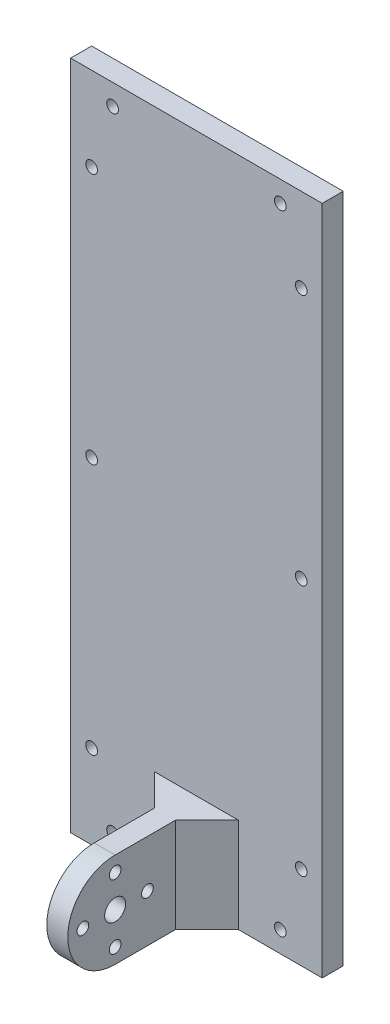
ISO-10303-21;
HEADER;
FILE_DESCRIPTION(('STEP AP214'),'2;1');
FILE_NAME('part.step','',(''),(''),'','','');
FILE_SCHEMA(('AUTOMOTIVE_DESIGN { 1 0 10303 214 1 1 1 1 }'));
ENDSEC;
DATA;
#1=APPLICATION_CONTEXT('core data for automotive mechanical design processes');
#2=APPLICATION_PROTOCOL_DEFINITION('international standard','automotive_design',2000,#1);
#3=PRODUCT_CONTEXT('',#1,'mechanical');
#4=PRODUCT('Part','Part','',(#3));
#5=PRODUCT_RELATED_PRODUCT_CATEGORY('part','',(#4));
#6=PRODUCT_DEFINITION_FORMATION('','',#4);
#7=PRODUCT_DEFINITION_CONTEXT('part definition',#1,'design');
#8=PRODUCT_DEFINITION('design','',#6,#7);
#9=PRODUCT_DEFINITION_SHAPE('','',#8);
#10=(LENGTH_UNIT() NAMED_UNIT(*) SI_UNIT(.MILLI.,.METRE.));
#11=(NAMED_UNIT(*) PLANE_ANGLE_UNIT() SI_UNIT($,.RADIAN.));
#12=(NAMED_UNIT(*) SI_UNIT($,.STERADIAN.) SOLID_ANGLE_UNIT());
#13=UNCERTAINTY_MEASURE_WITH_UNIT(LENGTH_MEASURE(1.E-05),#10,'distance_accuracy_value','');
#14=(GEOMETRIC_REPRESENTATION_CONTEXT(3) GLOBAL_UNCERTAINTY_ASSIGNED_CONTEXT((#13)) GLOBAL_UNIT_ASSIGNED_CONTEXT((#10,
#11,#12)) REPRESENTATION_CONTEXT('',''));
#15=CARTESIAN_POINT('',(0.,0.,0.));
#16=DIRECTION('',(0.,0.,1.));
#17=DIRECTION('',(1.,0.,0.));
#18=AXIS2_PLACEMENT_3D('',#15,#16,#17);
#19=CARTESIAN_POINT('',(0.,0.,6.35));
#20=DIRECTION('',(0.,1.,0.));
#21=DIRECTION('',(0.,0.,1.));
#22=AXIS2_PLACEMENT_3D('',#19,#20,#21);
#23=PLANE('',#22);
#24=DIRECTION('',(0.,0.,-1.));
#25=VECTOR('',#24,1.);
#26=CARTESIAN_POINT('',(34.925,0.,50.8));
#27=LINE('',#26,#25);
#28=CARTESIAN_POINT('',(34.925,0.,34.154615714));
#29=VERTEX_POINT('',#28);
#30=CARTESIAN_POINT('',(34.925,0.,15.875));
#31=VERTEX_POINT('',#30);
#32=EDGE_CURVE('E148',#29,#31,#27,.T.);
#33=ORIENTED_EDGE('',*,*,#32,.T.);
#34=DIRECTION('',(-0.707106781186548,0.,-0.707106781186547));
#35=VECTOR('',#34,1.);
#36=CARTESIAN_POINT('',(34.925,0.,15.875));
#37=LINE('',#36,#35);
#38=CARTESIAN_POINT('',(25.4,0.,6.35));
#39=VERTEX_POINT('',#38);
#40=EDGE_CURVE('E179',#31,#39,#37,.T.);
#41=ORIENTED_EDGE('',*,*,#40,.T.);
#42=DIRECTION('',(1.,0.,0.));
#43=VECTOR('',#42,1.);
#44=CARTESIAN_POINT('',(0.,0.,6.35));
#45=LINE('',#44,#43);
#46=CARTESIAN_POINT('',(0.,0.,6.35));
#47=VERTEX_POINT('',#46);
#48=EDGE_CURVE('E131',#47,#39,#45,.T.);
#49=ORIENTED_EDGE('',*,*,#48,.F.);
#50=DIRECTION('',(0.,0.,-1.));
#51=VECTOR('',#50,1.);
#52=CARTESIAN_POINT('',(0.,0.,6.35));
#53=LINE('',#52,#51);
#54=CARTESIAN_POINT('',(0.,0.,0.));
#55=VERTEX_POINT('',#54);
#56=EDGE_CURVE('E11',#47,#55,#53,.T.);
#57=ORIENTED_EDGE('',*,*,#56,.T.);
#58=DIRECTION('',(1.,0.,0.));
#59=VECTOR('',#58,1.);
#60=CARTESIAN_POINT('',(0.,0.,0.));
#61=LINE('',#60,#59);
#62=CARTESIAN_POINT('',(76.2,0.,0.));
#63=VERTEX_POINT('',#62);
#64=EDGE_CURVE('E147',#55,#63,#61,.T.);
#65=ORIENTED_EDGE('',*,*,#64,.T.);
#66=DIRECTION('',(0.,0.,-1.));
#67=VECTOR('',#66,1.);
#68=CARTESIAN_POINT('',(76.2,0.,6.35));
#69=LINE('',#68,#67);
#70=CARTESIAN_POINT('',(76.2,0.,6.35));
#71=VERTEX_POINT('',#70);
#72=EDGE_CURVE('E41',#71,#63,#69,.T.);
#73=ORIENTED_EDGE('',*,*,#72,.F.);
#74=CARTESIAN_POINT('',(50.8,0.,6.35));
#75=VERTEX_POINT('',#74);
#76=EDGE_CURVE('E126',#75,#71,#45,.T.);
#77=ORIENTED_EDGE('',*,*,#76,.F.);
#78=DIRECTION('',(-0.707106781186547,0.,0.707106781186548));
#79=VECTOR('',#78,1.);
#80=CARTESIAN_POINT('',(41.275,0.,15.875));
#81=LINE('',#80,#79);
#82=CARTESIAN_POINT('',(41.275,0.,15.875));
#83=VERTEX_POINT('',#82);
#84=EDGE_CURVE('E112',#75,#83,#81,.T.);
#85=ORIENTED_EDGE('',*,*,#84,.T.);
#86=DIRECTION('',(0.,0.,-1.));
#87=VECTOR('',#86,1.);
#88=CARTESIAN_POINT('',(41.275,0.,50.8));
#89=LINE('',#88,#87);
#90=CARTESIAN_POINT('',(41.275,0.,34.154615714));
#91=VERTEX_POINT('',#90);
#92=EDGE_CURVE('E295',#91,#83,#89,.T.);
#93=ORIENTED_EDGE('',*,*,#92,.F.);
#94=DIRECTION('',(1.,0.,0.));
#95=VECTOR('',#94,1.);
#96=CARTESIAN_POINT('',(34.925,0.,34.154615714));
#97=LINE('',#96,#95);
#98=EDGE_CURVE('E255',#29,#91,#97,.T.);
#99=ORIENTED_EDGE('',*,*,#98,.F.);
#100=EDGE_LOOP('',(#33,#41,#49,#57,#65,#73,#77,#85,#93,#99));
#101=FACE_BOUND('',#100,.T.);
#102=ADVANCED_FACE('F33',(#101),#23,.F.);
#103=CARTESIAN_POINT('',(34.925,28.702,50.8));
#104=DIRECTION('',(1.,0.,0.));
#105=DIRECTION('',(0.,1.,0.));
#106=AXIS2_PLACEMENT_3D('',#103,#104,#105);
#107=PLANE('',#106);
#108=CARTESIAN_POINT('',(34.925,14.351,34.154615714));
#109=DIRECTION('',(1.,0.,0.));
#110=DIRECTION('',(0.,0.,-1.));
#111=AXIS2_PLACEMENT_3D('',#108,#109,#110);
#112=CIRCLE('',#111,3.175);
#113=CARTESIAN_POINT('',(34.925,14.351,30.979615714));
#114=VERTEX_POINT('',#113);
#115=EDGE_CURVE('E284',#114,#114,#112,.T.);
#116=ORIENTED_EDGE('',*,*,#115,.T.);
#117=EDGE_LOOP('',(#116));
#118=FACE_BOUND('',#117,.T.);
#119=CARTESIAN_POINT('',(34.925,14.351,43.933615714));
#120=DIRECTION('',(1.,0.,0.));
#121=DIRECTION('',(0.,0.,-1.));
#122=AXIS2_PLACEMENT_3D('',#119,#120,#121);
#123=CIRCLE('',#122,1.778);
#124=CARTESIAN_POINT('',(34.925,14.351,42.155615714));
#125=VERTEX_POINT('',#124);
#126=EDGE_CURVE('E278',#125,#125,#123,.T.);
#127=ORIENTED_EDGE('',*,*,#126,.T.);
#128=EDGE_LOOP('',(#127));
#129=FACE_BOUND('',#128,.T.);
#130=CARTESIAN_POINT('',(34.925,24.13,34.1546157140001));
#131=DIRECTION('',(1.,0.,0.));
#132=DIRECTION('',(0.,-1.,0.));
#133=AXIS2_PLACEMENT_3D('',#130,#131,#132);
#134=CIRCLE('',#133,1.778);
#135=CARTESIAN_POINT('',(34.925,22.352,34.1546157140001));
#136=VERTEX_POINT('',#135);
#137=EDGE_CURVE('E273',#136,#136,#134,.T.);
#138=ORIENTED_EDGE('',*,*,#137,.T.);
#139=EDGE_LOOP('',(#138));
#140=FACE_BOUND('',#139,.T.);
#141=CARTESIAN_POINT('',(34.925,14.351,24.375615714));
#142=DIRECTION('',(1.,0.,0.));
#143=DIRECTION('',(0.,0.,1.));
#144=AXIS2_PLACEMENT_3D('',#141,#142,#143);
#145=CIRCLE('',#144,1.778);
#146=CARTESIAN_POINT('',(34.925,14.351,26.153615714));
#147=VERTEX_POINT('',#146);
#148=EDGE_CURVE('E267',#147,#147,#145,.T.);
#149=ORIENTED_EDGE('',*,*,#148,.T.);
#150=EDGE_LOOP('',(#149));
#151=FACE_BOUND('',#150,.T.);
#152=CARTESIAN_POINT('',(34.925,4.572,34.154615714));
#153=DIRECTION('',(1.,0.,0.));
#154=DIRECTION('',(0.,1.,0.));
#155=AXIS2_PLACEMENT_3D('',#152,#153,#154);
#156=CIRCLE('',#155,1.778);
#157=CARTESIAN_POINT('',(34.925,6.35,34.154615714));
#158=VERTEX_POINT('',#157);
#159=EDGE_CURVE('E260',#158,#158,#156,.T.);
#160=ORIENTED_EDGE('',*,*,#159,.T.);
#161=EDGE_LOOP('',(#160));
#162=FACE_BOUND('',#161,.T.);
#163=DIRECTION('',(0.,0.,-1.));
#164=VECTOR('',#163,1.);
#165=CARTESIAN_POINT('',(34.925,28.702,50.8));
#166=LINE('',#165,#164);
#167=CARTESIAN_POINT('',(34.925,28.702,34.154615714));
#168=VERTEX_POINT('',#167);
#169=CARTESIAN_POINT('',(34.925,28.702,15.875));
#170=VERTEX_POINT('',#169);
#171=EDGE_CURVE('E290',#168,#170,#166,.T.);
#172=ORIENTED_EDGE('',*,*,#171,.T.);
#173=DIRECTION('',(0.,-1.,0.));
#174=VECTOR('',#173,1.);
#175=CARTESIAN_POINT('',(34.925,42.1723841816037,15.875));
#176=LINE('',#175,#174);
#177=EDGE_CURVE('E48',#170,#31,#176,.T.);
#178=ORIENTED_EDGE('',*,*,#177,.T.);
#179=ORIENTED_EDGE('',*,*,#32,.F.);
#180=CARTESIAN_POINT('',(34.925,14.351,34.154615714));
#181=DIRECTION('',(1.,0.,0.));
#182=DIRECTION('',(0.,0.,-1.));
#183=AXIS2_PLACEMENT_3D('',#180,#181,#182);
#184=CIRCLE('',#183,14.351);
#185=EDGE_CURVE('E250',#168,#29,#184,.T.);
#186=ORIENTED_EDGE('',*,*,#185,.F.);
#187=EDGE_LOOP('',(#172,#178,#179,#186));
#188=FACE_BOUND('',#187,.T.);
#189=ADVANCED_FACE('F301',(#118,#129,#140,#151,#162,#188),#107,.F.);
#190=CARTESIAN_POINT('',(41.275,28.702,50.8));
#191=DIRECTION('',(-1.,0.,0.));
#192=DIRECTION('',(0.,0.,1.));
#193=AXIS2_PLACEMENT_3D('',#190,#191,#192);
#194=PLANE('',#193);
#195=CARTESIAN_POINT('',(41.275,14.351,34.154615714));
#196=DIRECTION('',(1.,0.,0.));
#197=DIRECTION('',(0.,0.,-1.));
#198=AXIS2_PLACEMENT_3D('',#195,#196,#197);
#199=CIRCLE('',#198,3.175);
#200=CARTESIAN_POINT('',(41.275,14.351,30.979615714));
#201=VERTEX_POINT('',#200);
#202=EDGE_CURVE('E281',#201,#201,#199,.T.);
#203=ORIENTED_EDGE('',*,*,#202,.F.);
#204=EDGE_LOOP('',(#203));
#205=FACE_BOUND('',#204,.T.);
#206=CARTESIAN_POINT('',(41.275,14.351,43.933615714));
#207=DIRECTION('',(1.,0.,0.));
#208=DIRECTION('',(0.,0.,-1.));
#209=AXIS2_PLACEMENT_3D('',#206,#207,#208);
#210=CIRCLE('',#209,1.778);
#211=CARTESIAN_POINT('',(41.275,14.351,42.155615714));
#212=VERTEX_POINT('',#211);
#213=EDGE_CURVE('E263',#212,#212,#210,.T.);
#214=ORIENTED_EDGE('',*,*,#213,.F.);
#215=EDGE_LOOP('',(#214));
#216=FACE_BOUND('',#215,.T.);
#217=CARTESIAN_POINT('',(41.275,24.13,34.1546157140001));
#218=DIRECTION('',(1.,0.,0.));
#219=DIRECTION('',(0.,-1.,0.));
#220=AXIS2_PLACEMENT_3D('',#217,#218,#219);
#221=CIRCLE('',#220,1.778);
#222=CARTESIAN_POINT('',(41.275,22.352,34.1546157140001));
#223=VERTEX_POINT('',#222);
#224=EDGE_CURVE('E257',#223,#223,#221,.T.);
#225=ORIENTED_EDGE('',*,*,#224,.F.);
#226=EDGE_LOOP('',(#225));
#227=FACE_BOUND('',#226,.T.);
#228=CARTESIAN_POINT('',(41.275,14.351,24.375615714));
#229=DIRECTION('',(1.,0.,0.));
#230=DIRECTION('',(0.,0.,1.));
#231=AXIS2_PLACEMENT_3D('',#228,#229,#230);
#232=CIRCLE('',#231,1.778);
#233=CARTESIAN_POINT('',(41.275,14.351,26.153615714));
#234=VERTEX_POINT('',#233);
#235=EDGE_CURVE('E270',#234,#234,#232,.T.);
#236=ORIENTED_EDGE('',*,*,#235,.F.);
#237=EDGE_LOOP('',(#236));
#238=FACE_BOUND('',#237,.T.);
#239=CARTESIAN_POINT('',(41.275,4.572,34.154615714));
#240=DIRECTION('',(1.,0.,0.));
#241=DIRECTION('',(0.,1.,0.));
#242=AXIS2_PLACEMENT_3D('',#239,#240,#241);
#243=CIRCLE('',#242,1.778);
#244=CARTESIAN_POINT('',(41.275,6.35,34.154615714));
#245=VERTEX_POINT('',#244);
#246=EDGE_CURVE('E264',#245,#245,#243,.T.);
#247=ORIENTED_EDGE('',*,*,#246,.F.);
#248=EDGE_LOOP('',(#247));
#249=FACE_BOUND('',#248,.T.);
#250=ORIENTED_EDGE('',*,*,#92,.T.);
#251=DIRECTION('',(0.,-1.,0.));
#252=VECTOR('',#251,1.);
#253=CARTESIAN_POINT('',(41.275,42.1723841816037,15.875));
#254=LINE('',#253,#252);
#255=CARTESIAN_POINT('',(41.275,28.702,15.875));
#256=VERTEX_POINT('',#255);
#257=EDGE_CURVE('E117',#256,#83,#254,.T.);
#258=ORIENTED_EDGE('',*,*,#257,.F.);
#259=DIRECTION('',(0.,0.,-1.));
#260=VECTOR('',#259,1.);
#261=CARTESIAN_POINT('',(41.275,28.702,50.8));
#262=LINE('',#261,#260);
#263=CARTESIAN_POINT('',(41.275,28.702,34.154615714));
#264=VERTEX_POINT('',#263);
#265=EDGE_CURVE('E292',#264,#256,#262,.T.);
#266=ORIENTED_EDGE('',*,*,#265,.F.);
#267=CARTESIAN_POINT('',(41.275,14.351,34.154615714));
#268=DIRECTION('',(1.,0.,0.));
#269=DIRECTION('',(0.,0.,-1.));
#270=AXIS2_PLACEMENT_3D('',#267,#268,#269);
#271=CIRCLE('',#270,14.351);
#272=EDGE_CURVE('E247',#264,#91,#271,.T.);
#273=ORIENTED_EDGE('',*,*,#272,.T.);
#274=EDGE_LOOP('',(#250,#258,#266,#273));
#275=FACE_BOUND('',#274,.T.);
#276=ADVANCED_FACE('F297',(#205,#216,#227,#238,#249,#275),#194,.F.);
#277=CARTESIAN_POINT('',(0.,0.,6.35));
#278=DIRECTION('',(0.,0.,-1.));
#279=DIRECTION('',(-1.,0.,0.));
#280=AXIS2_PLACEMENT_3D('',#277,#278,#279);
#281=PLANE('',#280);
#282=CARTESIAN_POINT('',(69.85,177.8,6.35));
#283=DIRECTION('',(0.,0.,-1.));
#284=DIRECTION('',(-1.,0.,0.));
#285=AXIS2_PLACEMENT_3D('',#282,#283,#284);
#286=CIRCLE('',#285,1.778);
#287=CARTESIAN_POINT('',(68.072,177.8,6.35));
#288=VERTEX_POINT('',#287);
#289=EDGE_CURVE('E208',#288,#288,#286,.T.);
#290=ORIENTED_EDGE('',*,*,#289,.T.);
#291=EDGE_LOOP('',(#290));
#292=FACE_BOUND('',#291,.T.);
#293=CARTESIAN_POINT('',(63.5,196.85,6.35));
#294=DIRECTION('',(0.,0.,-1.));
#295=DIRECTION('',(-1.,0.,0.));
#296=AXIS2_PLACEMENT_3D('',#293,#294,#295);
#297=CIRCLE('',#296,1.77799999999999);
#298=CARTESIAN_POINT('',(61.722,196.85,6.35));
#299=VERTEX_POINT('',#298);
#300=EDGE_CURVE('E215',#299,#299,#297,.T.);
#301=ORIENTED_EDGE('',*,*,#300,.T.);
#302=EDGE_LOOP('',(#301));
#303=FACE_BOUND('',#302,.T.);
#304=CARTESIAN_POINT('',(12.7,196.85,6.35));
#305=DIRECTION('',(0.,0.,-1.));
#306=DIRECTION('',(-1.,0.,0.));
#307=AXIS2_PLACEMENT_3D('',#304,#305,#306);
#308=CIRCLE('',#307,1.778);
#309=CARTESIAN_POINT('',(10.922,196.85,6.35));
#310=VERTEX_POINT('',#309);
#311=EDGE_CURVE('E196',#310,#310,#308,.T.);
#312=ORIENTED_EDGE('',*,*,#311,.T.);
#313=EDGE_LOOP('',(#312));
#314=FACE_BOUND('',#313,.T.);
#315=CARTESIAN_POINT('',(69.85,101.6,6.35));
#316=DIRECTION('',(0.,0.,-1.));
#317=DIRECTION('',(-1.,0.,0.));
#318=AXIS2_PLACEMENT_3D('',#315,#316,#317);
#319=CIRCLE('',#318,1.778);
#320=CARTESIAN_POINT('',(68.072,101.6,6.35));
#321=VERTEX_POINT('',#320);
#322=EDGE_CURVE('E203',#321,#321,#319,.T.);
#323=ORIENTED_EDGE('',*,*,#322,.T.);
#324=EDGE_LOOP('',(#323));
#325=FACE_BOUND('',#324,.T.);
#326=CARTESIAN_POINT('',(12.7,6.35,6.35));
#327=DIRECTION('',(0.,0.,-1.));
#328=DIRECTION('',(-1.,0.,0.));
#329=AXIS2_PLACEMENT_3D('',#326,#327,#328);
#330=CIRCLE('',#329,1.778);
#331=CARTESIAN_POINT('',(10.922,6.35,6.35));
#332=VERTEX_POINT('',#331);
#333=EDGE_CURVE('E232',#332,#332,#330,.T.);
#334=ORIENTED_EDGE('',*,*,#333,.T.);
#335=EDGE_LOOP('',(#334));
#336=FACE_BOUND('',#335,.T.);
#337=CARTESIAN_POINT('',(6.35,177.8,6.35));
#338=DIRECTION('',(0.,0.,-1.));
#339=DIRECTION('',(-1.,0.,0.));
#340=AXIS2_PLACEMENT_3D('',#337,#338,#339);
#341=CIRCLE('',#340,1.77799999999999);
#342=CARTESIAN_POINT('',(4.57200000000001,177.8,6.35));
#343=VERTEX_POINT('',#342);
#344=EDGE_CURVE('E239',#343,#343,#341,.T.);
#345=ORIENTED_EDGE('',*,*,#344,.T.);
#346=EDGE_LOOP('',(#345));
#347=FACE_BOUND('',#346,.T.);
#348=CARTESIAN_POINT('',(6.35,25.4,6.35));
#349=DIRECTION('',(0.,0.,-1.));
#350=DIRECTION('',(-1.,0.,0.));
#351=AXIS2_PLACEMENT_3D('',#348,#349,#350);
#352=CIRCLE('',#351,1.778);
#353=CARTESIAN_POINT('',(4.572,25.4,6.35));
#354=VERTEX_POINT('',#353);
#355=EDGE_CURVE('E220',#354,#354,#352,.T.);
#356=ORIENTED_EDGE('',*,*,#355,.T.);
#357=EDGE_LOOP('',(#356));
#358=FACE_BOUND('',#357,.T.);
#359=CARTESIAN_POINT('',(69.85,25.4,6.35));
#360=DIRECTION('',(0.,0.,-1.));
#361=DIRECTION('',(-1.,0.,0.));
#362=AXIS2_PLACEMENT_3D('',#359,#360,#361);
#363=CIRCLE('',#362,1.77800000000001);
#364=CARTESIAN_POINT('',(68.072,25.4,6.35));
#365=VERTEX_POINT('',#364);
#366=EDGE_CURVE('E227',#365,#365,#363,.T.);
#367=ORIENTED_EDGE('',*,*,#366,.T.);
#368=EDGE_LOOP('',(#367));
#369=FACE_BOUND('',#368,.T.);
#370=CARTESIAN_POINT('',(6.35,101.6,6.35));
#371=DIRECTION('',(0.,0.,-1.));
#372=DIRECTION('',(-1.,0.,0.));
#373=AXIS2_PLACEMENT_3D('',#370,#371,#372);
#374=CIRCLE('',#373,1.778);
#375=CARTESIAN_POINT('',(4.572,101.6,6.35));
#376=VERTEX_POINT('',#375);
#377=EDGE_CURVE('E190',#376,#376,#374,.T.);
#378=ORIENTED_EDGE('',*,*,#377,.T.);
#379=EDGE_LOOP('',(#378));
#380=FACE_BOUND('',#379,.T.);
#381=CARTESIAN_POINT('',(63.5,6.35,6.35));
#382=DIRECTION('',(0.,0.,-1.));
#383=DIRECTION('',(-1.,0.,0.));
#384=AXIS2_PLACEMENT_3D('',#381,#382,#383);
#385=CIRCLE('',#384,1.778);
#386=CARTESIAN_POINT('',(61.722,6.35,6.35));
#387=VERTEX_POINT('',#386);
#388=EDGE_CURVE('E244',#387,#387,#385,.T.);
#389=ORIENTED_EDGE('',*,*,#388,.T.);
#390=EDGE_LOOP('',(#389));
#391=FACE_BOUND('',#390,.T.);
#392=ORIENTED_EDGE('',*,*,#48,.T.);
#393=DIRECTION('',(0.,-1.,0.));
#394=VECTOR('',#393,1.);
#395=CARTESIAN_POINT('',(25.4,42.1723841816037,6.35));
#396=LINE('',#395,#394);
#397=CARTESIAN_POINT('',(25.4,28.702,6.35));
#398=VERTEX_POINT('',#397);
#399=EDGE_CURVE('E173',#398,#39,#396,.T.);
#400=ORIENTED_EDGE('',*,*,#399,.F.);
#401=DIRECTION('',(-1.,0.,0.));
#402=VECTOR('',#401,1.);
#403=CARTESIAN_POINT('',(34.925,28.702,6.35));
#404=LINE('',#403,#402);
#405=CARTESIAN_POINT('',(50.8,28.702,6.35));
#406=VERTEX_POINT('',#405);
#407=EDGE_CURVE('E56',#406,#398,#404,.T.);
#408=ORIENTED_EDGE('',*,*,#407,.F.);
#409=DIRECTION('',(0.,-1.,0.));
#410=VECTOR('',#409,1.);
#411=CARTESIAN_POINT('',(50.8,42.1723841816037,6.35));
#412=LINE('',#411,#410);
#413=EDGE_CURVE('E115',#406,#75,#412,.T.);
#414=ORIENTED_EDGE('',*,*,#413,.T.);
#415=ORIENTED_EDGE('',*,*,#76,.T.);
#416=DIRECTION('',(0.,1.,0.));
#417=VECTOR('',#416,1.);
#418=CARTESIAN_POINT('',(76.2,0.,6.35));
#419=LINE('',#418,#417);
#420=CARTESIAN_POINT('',(76.2,203.2,6.35));
#421=VERTEX_POINT('',#420);
#422=EDGE_CURVE('E134',#71,#421,#419,.T.);
#423=ORIENTED_EDGE('',*,*,#422,.T.);
#424=DIRECTION('',(-1.,0.,0.));
#425=VECTOR('',#424,1.);
#426=CARTESIAN_POINT('',(0.,203.2,6.35));
#427=LINE('',#426,#425);
#428=CARTESIAN_POINT('',(0.,203.2,6.35));
#429=VERTEX_POINT('',#428);
#430=EDGE_CURVE('E141',#421,#429,#427,.T.);
#431=ORIENTED_EDGE('',*,*,#430,.T.);
#432=DIRECTION('',(0.,-1.,0.));
#433=VECTOR('',#432,1.);
#434=CARTESIAN_POINT('',(0.,0.,6.35));
#435=LINE('',#434,#433);
#436=EDGE_CURVE('E132',#429,#47,#435,.T.);
#437=ORIENTED_EDGE('',*,*,#436,.T.);
#438=EDGE_LOOP('',(#392,#400,#408,#414,#415,#423,#431,#437));
#439=FACE_BOUND('',#438,.T.);
#440=ADVANCED_FACE('F125',(#292,#303,#314,#325,#336,#347,#358,#369,#380,#391,#439),#281,.F.);
#441=CARTESIAN_POINT('',(0.,0.,6.35));
#442=DIRECTION('',(1.,0.,0.));
#443=DIRECTION('',(0.,0.,-1.));
#444=AXIS2_PLACEMENT_3D('',#441,#442,#443);
#445=PLANE('',#444);
#446=DIRECTION('',(0.,-1.,0.));
#447=VECTOR('',#446,1.);
#448=CARTESIAN_POINT('',(0.,0.,0.));
#449=LINE('',#448,#447);
#450=CARTESIAN_POINT('',(0.,203.2,0.));
#451=VERTEX_POINT('',#450);
#452=EDGE_CURVE('E144',#451,#55,#449,.T.);
#453=ORIENTED_EDGE('',*,*,#452,.T.);
#454=ORIENTED_EDGE('',*,*,#56,.F.);
#455=ORIENTED_EDGE('',*,*,#436,.F.);
#456=DIRECTION('',(0.,0.,-1.));
#457=VECTOR('',#456,1.);
#458=CARTESIAN_POINT('',(0.,203.2,6.35));
#459=LINE('',#458,#457);
#460=EDGE_CURVE('E143',#429,#451,#459,.T.);
#461=ORIENTED_EDGE('',*,*,#460,.T.);
#462=EDGE_LOOP('',(#453,#454,#455,#461));
#463=FACE_BOUND('',#462,.T.);
#464=ADVANCED_FACE('F35',(#463),#445,.F.);
#465=CARTESIAN_POINT('',(76.2,0.,6.35));
#466=DIRECTION('',(-1.,0.,0.));
#467=DIRECTION('',(0.,0.,1.));
#468=AXIS2_PLACEMENT_3D('',#465,#466,#467);
#469=PLANE('',#468);
#470=DIRECTION('',(0.,1.,0.));
#471=VECTOR('',#470,1.);
#472=CARTESIAN_POINT('',(76.2,0.,0.));
#473=LINE('',#472,#471);
#474=CARTESIAN_POINT('',(76.2,203.2,0.));
#475=VERTEX_POINT('',#474);
#476=EDGE_CURVE('E150',#63,#475,#473,.T.);
#477=ORIENTED_EDGE('',*,*,#476,.T.);
#478=DIRECTION('',(0.,0.,-1.));
#479=VECTOR('',#478,1.);
#480=CARTESIAN_POINT('',(76.2,203.2,6.35));
#481=LINE('',#480,#479);
#482=EDGE_CURVE('E155',#421,#475,#481,.T.);
#483=ORIENTED_EDGE('',*,*,#482,.F.);
#484=ORIENTED_EDGE('',*,*,#422,.F.);
#485=ORIENTED_EDGE('',*,*,#72,.T.);
#486=EDGE_LOOP('',(#477,#483,#484,#485));
#487=FACE_BOUND('',#486,.T.);
#488=ADVANCED_FACE('F159',(#487),#469,.F.);
#489=CARTESIAN_POINT('',(0.,203.2,6.35));
#490=DIRECTION('',(0.,-1.,0.));
#491=DIRECTION('',(0.,0.,-1.));
#492=AXIS2_PLACEMENT_3D('',#489,#490,#491);
#493=PLANE('',#492);
#494=DIRECTION('',(-1.,0.,0.));
#495=VECTOR('',#494,1.);
#496=CARTESIAN_POINT('',(0.,203.2,0.));
#497=LINE('',#496,#495);
#498=EDGE_CURVE('E136',#475,#451,#497,.T.);
#499=ORIENTED_EDGE('',*,*,#498,.T.);
#500=ORIENTED_EDGE('',*,*,#460,.F.);
#501=ORIENTED_EDGE('',*,*,#430,.F.);
#502=ORIENTED_EDGE('',*,*,#482,.T.);
#503=EDGE_LOOP('',(#499,#500,#501,#502));
#504=FACE_BOUND('',#503,.T.);
#505=ADVANCED_FACE('F167',(#504),#493,.F.);
#506=CARTESIAN_POINT('',(0.,0.,0.));
#507=DIRECTION('',(0.,0.,-1.));
#508=DIRECTION('',(-1.,0.,0.));
#509=AXIS2_PLACEMENT_3D('',#506,#507,#508);
#510=PLANE('',#509);
#511=CARTESIAN_POINT('',(69.85,177.8,0.));
#512=DIRECTION('',(0.,0.,-1.));
#513=DIRECTION('',(-1.,0.,0.));
#514=AXIS2_PLACEMENT_3D('',#511,#512,#513);
#515=CIRCLE('',#514,1.778);
#516=CARTESIAN_POINT('',(68.072,177.8,0.));
#517=VERTEX_POINT('',#516);
#518=EDGE_CURVE('E212',#517,#517,#515,.T.);
#519=ORIENTED_EDGE('',*,*,#518,.F.);
#520=EDGE_LOOP('',(#519));
#521=FACE_BOUND('',#520,.T.);
#522=CARTESIAN_POINT('',(63.5,196.85,0.));
#523=DIRECTION('',(0.,0.,-1.));
#524=DIRECTION('',(-1.,0.,0.));
#525=AXIS2_PLACEMENT_3D('',#522,#523,#524);
#526=CIRCLE('',#525,1.77799999999999);
#527=CARTESIAN_POINT('',(61.722,196.85,0.));
#528=VERTEX_POINT('',#527);
#529=EDGE_CURVE('E199',#528,#528,#526,.T.);
#530=ORIENTED_EDGE('',*,*,#529,.F.);
#531=EDGE_LOOP('',(#530));
#532=FACE_BOUND('',#531,.T.);
#533=CARTESIAN_POINT('',(12.7,196.85,0.));
#534=DIRECTION('',(0.,0.,-1.));
#535=DIRECTION('',(-1.,0.,0.));
#536=AXIS2_PLACEMENT_3D('',#533,#534,#535);
#537=CIRCLE('',#536,1.778);
#538=CARTESIAN_POINT('',(10.922,196.85,0.));
#539=VERTEX_POINT('',#538);
#540=EDGE_CURVE('E200',#539,#539,#537,.T.);
#541=ORIENTED_EDGE('',*,*,#540,.F.);
#542=EDGE_LOOP('',(#541));
#543=FACE_BOUND('',#542,.T.);
#544=CARTESIAN_POINT('',(69.85,101.6,0.));
#545=DIRECTION('',(0.,0.,-1.));
#546=DIRECTION('',(-1.,0.,0.));
#547=AXIS2_PLACEMENT_3D('',#544,#545,#546);
#548=CIRCLE('',#547,1.778);
#549=CARTESIAN_POINT('',(68.072,101.6,0.));
#550=VERTEX_POINT('',#549);
#551=EDGE_CURVE('E193',#550,#550,#548,.T.);
#552=ORIENTED_EDGE('',*,*,#551,.F.);
#553=EDGE_LOOP('',(#552));
#554=FACE_BOUND('',#553,.T.);
#555=CARTESIAN_POINT('',(12.7,6.35,0.));
#556=DIRECTION('',(0.,0.,-1.));
#557=DIRECTION('',(-1.,0.,0.));
#558=AXIS2_PLACEMENT_3D('',#555,#556,#557);
#559=CIRCLE('',#558,1.778);
#560=CARTESIAN_POINT('',(10.922,6.35,0.));
#561=VERTEX_POINT('',#560);
#562=EDGE_CURVE('E236',#561,#561,#559,.T.);
#563=ORIENTED_EDGE('',*,*,#562,.F.);
#564=EDGE_LOOP('',(#563));
#565=FACE_BOUND('',#564,.T.);
#566=CARTESIAN_POINT('',(6.35,177.8,0.));
#567=DIRECTION('',(0.,0.,-1.));
#568=DIRECTION('',(-1.,0.,0.));
#569=AXIS2_PLACEMENT_3D('',#566,#567,#568);
#570=CIRCLE('',#569,1.77799999999999);
#571=CARTESIAN_POINT('',(4.57200000000001,177.8,0.));
#572=VERTEX_POINT('',#571);
#573=EDGE_CURVE('E223',#572,#572,#570,.T.);
#574=ORIENTED_EDGE('',*,*,#573,.F.);
#575=EDGE_LOOP('',(#574));
#576=FACE_BOUND('',#575,.T.);
#577=CARTESIAN_POINT('',(6.35,25.4,0.));
#578=DIRECTION('',(0.,0.,-1.));
#579=DIRECTION('',(-1.,0.,0.));
#580=AXIS2_PLACEMENT_3D('',#577,#578,#579);
#581=CIRCLE('',#580,1.778);
#582=CARTESIAN_POINT('',(4.572,25.4,0.));
#583=VERTEX_POINT('',#582);
#584=EDGE_CURVE('E224',#583,#583,#581,.T.);
#585=ORIENTED_EDGE('',*,*,#584,.F.);
#586=EDGE_LOOP('',(#585));
#587=FACE_BOUND('',#586,.T.);
#588=CARTESIAN_POINT('',(69.85,25.4,0.));
#589=DIRECTION('',(0.,0.,-1.));
#590=DIRECTION('',(-1.,0.,0.));
#591=AXIS2_PLACEMENT_3D('',#588,#589,#590);
#592=CIRCLE('',#591,1.77800000000001);
#593=CARTESIAN_POINT('',(68.072,25.4,0.));
#594=VERTEX_POINT('',#593);
#595=EDGE_CURVE('E211',#594,#594,#592,.T.);
#596=ORIENTED_EDGE('',*,*,#595,.F.);
#597=EDGE_LOOP('',(#596));
#598=FACE_BOUND('',#597,.T.);
#599=CARTESIAN_POINT('',(6.35,101.6,0.));
#600=DIRECTION('',(0.,0.,-1.));
#601=DIRECTION('',(-1.,0.,0.));
#602=AXIS2_PLACEMENT_3D('',#599,#600,#601);
#603=CIRCLE('',#602,1.778);
#604=CARTESIAN_POINT('',(4.572,101.6,0.));
#605=VERTEX_POINT('',#604);
#606=EDGE_CURVE('E189',#605,#605,#603,.T.);
#607=ORIENTED_EDGE('',*,*,#606,.F.);
#608=EDGE_LOOP('',(#607));
#609=FACE_BOUND('',#608,.T.);
#610=CARTESIAN_POINT('',(63.5,6.35,0.));
#611=DIRECTION('',(0.,0.,-1.));
#612=DIRECTION('',(-1.,0.,0.));
#613=AXIS2_PLACEMENT_3D('',#610,#611,#612);
#614=CIRCLE('',#613,1.778);
#615=CARTESIAN_POINT('',(61.722,6.35,0.));
#616=VERTEX_POINT('',#615);
#617=EDGE_CURVE('E235',#616,#616,#614,.T.);
#618=ORIENTED_EDGE('',*,*,#617,.F.);
#619=EDGE_LOOP('',(#618));
#620=FACE_BOUND('',#619,.T.);
#621=ORIENTED_EDGE('',*,*,#452,.F.);
#622=ORIENTED_EDGE('',*,*,#498,.F.);
#623=ORIENTED_EDGE('',*,*,#476,.F.);
#624=ORIENTED_EDGE('',*,*,#64,.F.);
#625=EDGE_LOOP('',(#621,#622,#623,#624));
#626=FACE_BOUND('',#625,.T.);
#627=ADVANCED_FACE('F164',(#521,#532,#543,#554,#565,#576,#587,#598,#609,#620,#626),#510,.T.);
#628=CARTESIAN_POINT('',(34.925,28.702,50.8));
#629=DIRECTION('',(0.,-1.,0.));
#630=DIRECTION('',(0.,0.,-1.));
#631=AXIS2_PLACEMENT_3D('',#628,#629,#630);
#632=PLANE('',#631);
#633=ORIENTED_EDGE('',*,*,#171,.F.);
#634=DIRECTION('',(1.,0.,0.));
#635=VECTOR('',#634,1.);
#636=CARTESIAN_POINT('',(34.925,28.702,34.154615714));
#637=LINE('',#636,#635);
#638=EDGE_CURVE('E252',#168,#264,#637,.T.);
#639=ORIENTED_EDGE('',*,*,#638,.T.);
#640=ORIENTED_EDGE('',*,*,#265,.T.);
#641=DIRECTION('',(0.707106781186547,0.,-0.707106781186548));
#642=VECTOR('',#641,1.);
#643=CARTESIAN_POINT('',(41.275,28.702,15.875));
#644=LINE('',#643,#642);
#645=EDGE_CURVE('E186',#256,#406,#644,.T.);
#646=ORIENTED_EDGE('',*,*,#645,.T.);
#647=ORIENTED_EDGE('',*,*,#407,.T.);
#648=DIRECTION('',(0.707106781186548,0.,0.707106781186547));
#649=VECTOR('',#648,1.);
#650=CARTESIAN_POINT('',(34.925,28.702,15.875));
#651=LINE('',#650,#649);
#652=EDGE_CURVE('E122',#398,#170,#651,.T.);
#653=ORIENTED_EDGE('',*,*,#652,.T.);
#654=EDGE_LOOP('',(#633,#639,#640,#646,#647,#653));
#655=FACE_BOUND('',#654,.T.);
#656=ADVANCED_FACE('F303',(#655),#632,.F.);
#657=CARTESIAN_POINT('',(34.925,14.351,34.154615714));
#658=DIRECTION('',(1.,0.,0.));
#659=DIRECTION('',(0.,0.,-1.));
#660=AXIS2_PLACEMENT_3D('',#657,#658,#659);
#661=CYLINDRICAL_SURFACE('',#660,3.175);
#662=ORIENTED_EDGE('',*,*,#115,.F.);
#663=EDGE_LOOP('',(#662));
#664=FACE_BOUND('',#663,.T.);
#665=ORIENTED_EDGE('',*,*,#202,.T.);
#666=EDGE_LOOP('',(#665));
#667=FACE_BOUND('',#666,.T.);
#668=ADVANCED_FACE('F342',(#664,#667),#661,.F.);
#669=CARTESIAN_POINT('',(34.925,14.351,43.933615714));
#670=DIRECTION('',(1.,0.,0.));
#671=DIRECTION('',(0.,0.,-1.));
#672=AXIS2_PLACEMENT_3D('',#669,#670,#671);
#673=CYLINDRICAL_SURFACE('',#672,1.778);
#674=ORIENTED_EDGE('',*,*,#126,.F.);
#675=EDGE_LOOP('',(#674));
#676=FACE_BOUND('',#675,.T.);
#677=ORIENTED_EDGE('',*,*,#213,.T.);
#678=EDGE_LOOP('',(#677));
#679=FACE_BOUND('',#678,.T.);
#680=ADVANCED_FACE('F345',(#676,#679),#673,.F.);
#681=CARTESIAN_POINT('',(34.925,24.13,34.1546157140001));
#682=DIRECTION('',(1.,0.,0.));
#683=DIRECTION('',(0.,0.,-1.));
#684=AXIS2_PLACEMENT_3D('',#681,#682,#683);
#685=CYLINDRICAL_SURFACE('',#684,1.778);
#686=ORIENTED_EDGE('',*,*,#137,.F.);
#687=EDGE_LOOP('',(#686));
#688=FACE_BOUND('',#687,.T.);
#689=ORIENTED_EDGE('',*,*,#224,.T.);
#690=EDGE_LOOP('',(#689));
#691=FACE_BOUND('',#690,.T.);
#692=ADVANCED_FACE('F349',(#688,#691),#685,.F.);
#693=CARTESIAN_POINT('',(34.925,14.351,24.375615714));
#694=DIRECTION('',(1.,0.,0.));
#695=DIRECTION('',(0.,0.,-1.));
#696=AXIS2_PLACEMENT_3D('',#693,#694,#695);
#697=CYLINDRICAL_SURFACE('',#696,1.778);
#698=ORIENTED_EDGE('',*,*,#148,.F.);
#699=EDGE_LOOP('',(#698));
#700=FACE_BOUND('',#699,.T.);
#701=ORIENTED_EDGE('',*,*,#235,.T.);
#702=EDGE_LOOP('',(#701));
#703=FACE_BOUND('',#702,.T.);
#704=ADVANCED_FACE('F316',(#700,#703),#697,.F.);
#705=CARTESIAN_POINT('',(34.925,4.572,34.154615714));
#706=DIRECTION('',(1.,0.,0.));
#707=DIRECTION('',(0.,0.,-1.));
#708=AXIS2_PLACEMENT_3D('',#705,#706,#707);
#709=CYLINDRICAL_SURFACE('',#708,1.778);
#710=ORIENTED_EDGE('',*,*,#159,.F.);
#711=EDGE_LOOP('',(#710));
#712=FACE_BOUND('',#711,.T.);
#713=ORIENTED_EDGE('',*,*,#246,.T.);
#714=EDGE_LOOP('',(#713));
#715=FACE_BOUND('',#714,.T.);
#716=ADVANCED_FACE('F307',(#712,#715),#709,.F.);
#717=CARTESIAN_POINT('',(34.925,14.351,34.154615714));
#718=DIRECTION('',(1.,0.,0.));
#719=DIRECTION('',(0.,0.,-1.));
#720=AXIS2_PLACEMENT_3D('',#717,#718,#719);
#721=CYLINDRICAL_SURFACE('',#720,14.351);
#722=ORIENTED_EDGE('',*,*,#272,.F.);
#723=ORIENTED_EDGE('',*,*,#638,.F.);
#724=ORIENTED_EDGE('',*,*,#185,.T.);
#725=ORIENTED_EDGE('',*,*,#98,.T.);
#726=EDGE_LOOP('',(#722,#723,#724,#725));
#727=FACE_BOUND('',#726,.T.);
#728=ADVANCED_FACE('F304',(#727),#721,.T.);
#729=CARTESIAN_POINT('',(63.5,6.35,6.35));
#730=DIRECTION('',(0.,0.,-1.));
#731=DIRECTION('',(-1.,0.,0.));
#732=AXIS2_PLACEMENT_3D('',#729,#730,#731);
#733=CYLINDRICAL_SURFACE('',#732,1.778);
#734=ORIENTED_EDGE('',*,*,#388,.F.);
#735=EDGE_LOOP('',(#734));
#736=FACE_BOUND('',#735,.T.);
#737=ORIENTED_EDGE('',*,*,#617,.T.);
#738=EDGE_LOOP('',(#737));
#739=FACE_BOUND('',#738,.T.);
#740=ADVANCED_FACE('F306',(#736,#739),#733,.F.);
#741=CARTESIAN_POINT('',(6.35,101.6,6.35));
#742=DIRECTION('',(0.,0.,-1.));
#743=DIRECTION('',(-1.,0.,0.));
#744=AXIS2_PLACEMENT_3D('',#741,#742,#743);
#745=CYLINDRICAL_SURFACE('',#744,1.778);
#746=ORIENTED_EDGE('',*,*,#377,.F.);
#747=EDGE_LOOP('',(#746));
#748=FACE_BOUND('',#747,.T.);
#749=ORIENTED_EDGE('',*,*,#606,.T.);
#750=EDGE_LOOP('',(#749));
#751=FACE_BOUND('',#750,.T.);
#752=ADVANCED_FACE('F313',(#748,#751),#745,.F.);
#753=CARTESIAN_POINT('',(69.85,25.4,6.35));
#754=DIRECTION('',(0.,0.,-1.));
#755=DIRECTION('',(-1.,0.,0.));
#756=AXIS2_PLACEMENT_3D('',#753,#754,#755);
#757=CYLINDRICAL_SURFACE('',#756,1.77800000000001);
#758=ORIENTED_EDGE('',*,*,#366,.F.);
#759=EDGE_LOOP('',(#758));
#760=FACE_BOUND('',#759,.T.);
#761=ORIENTED_EDGE('',*,*,#595,.T.);
#762=EDGE_LOOP('',(#761));
#763=FACE_BOUND('',#762,.T.);
#764=ADVANCED_FACE('F399',(#760,#763),#757,.F.);
#765=CARTESIAN_POINT('',(6.35,25.4,6.35));
#766=DIRECTION('',(0.,0.,-1.));
#767=DIRECTION('',(-1.,0.,0.));
#768=AXIS2_PLACEMENT_3D('',#765,#766,#767);
#769=CYLINDRICAL_SURFACE('',#768,1.778);
#770=ORIENTED_EDGE('',*,*,#355,.F.);
#771=EDGE_LOOP('',(#770));
#772=FACE_BOUND('',#771,.T.);
#773=ORIENTED_EDGE('',*,*,#584,.T.);
#774=EDGE_LOOP('',(#773));
#775=FACE_BOUND('',#774,.T.);
#776=ADVANCED_FACE('F409',(#772,#775),#769,.F.);
#777=CARTESIAN_POINT('',(6.35,177.8,6.35));
#778=DIRECTION('',(0.,0.,-1.));
#779=DIRECTION('',(-1.,0.,0.));
#780=AXIS2_PLACEMENT_3D('',#777,#778,#779);
#781=CYLINDRICAL_SURFACE('',#780,1.77799999999999);
#782=ORIENTED_EDGE('',*,*,#344,.F.);
#783=EDGE_LOOP('',(#782));
#784=FACE_BOUND('',#783,.T.);
#785=ORIENTED_EDGE('',*,*,#573,.T.);
#786=EDGE_LOOP('',(#785));
#787=FACE_BOUND('',#786,.T.);
#788=ADVANCED_FACE('F419',(#784,#787),#781,.F.);
#789=CARTESIAN_POINT('',(12.7,6.35,6.35));
#790=DIRECTION('',(0.,0.,-1.));
#791=DIRECTION('',(-1.,0.,0.));
#792=AXIS2_PLACEMENT_3D('',#789,#790,#791);
#793=CYLINDRICAL_SURFACE('',#792,1.778);
#794=ORIENTED_EDGE('',*,*,#333,.F.);
#795=EDGE_LOOP('',(#794));
#796=FACE_BOUND('',#795,.T.);
#797=ORIENTED_EDGE('',*,*,#562,.T.);
#798=EDGE_LOOP('',(#797));
#799=FACE_BOUND('',#798,.T.);
#800=ADVANCED_FACE('F429',(#796,#799),#793,.F.);
#801=CARTESIAN_POINT('',(69.85,101.6,6.35));
#802=DIRECTION('',(0.,0.,-1.));
#803=DIRECTION('',(-1.,0.,0.));
#804=AXIS2_PLACEMENT_3D('',#801,#802,#803);
#805=CYLINDRICAL_SURFACE('',#804,1.778);
#806=ORIENTED_EDGE('',*,*,#322,.F.);
#807=EDGE_LOOP('',(#806));
#808=FACE_BOUND('',#807,.T.);
#809=ORIENTED_EDGE('',*,*,#551,.T.);
#810=EDGE_LOOP('',(#809));
#811=FACE_BOUND('',#810,.T.);
#812=ADVANCED_FACE('F439',(#808,#811),#805,.F.);
#813=CARTESIAN_POINT('',(12.7,196.85,6.35));
#814=DIRECTION('',(0.,0.,-1.));
#815=DIRECTION('',(-1.,0.,0.));
#816=AXIS2_PLACEMENT_3D('',#813,#814,#815);
#817=CYLINDRICAL_SURFACE('',#816,1.778);
#818=ORIENTED_EDGE('',*,*,#311,.F.);
#819=EDGE_LOOP('',(#818));
#820=FACE_BOUND('',#819,.T.);
#821=ORIENTED_EDGE('',*,*,#540,.T.);
#822=EDGE_LOOP('',(#821));
#823=FACE_BOUND('',#822,.T.);
#824=ADVANCED_FACE('F449',(#820,#823),#817,.F.);
#825=CARTESIAN_POINT('',(63.5,196.85,6.35));
#826=DIRECTION('',(0.,0.,-1.));
#827=DIRECTION('',(-1.,0.,0.));
#828=AXIS2_PLACEMENT_3D('',#825,#826,#827);
#829=CYLINDRICAL_SURFACE('',#828,1.77799999999999);
#830=ORIENTED_EDGE('',*,*,#300,.F.);
#831=EDGE_LOOP('',(#830));
#832=FACE_BOUND('',#831,.T.);
#833=ORIENTED_EDGE('',*,*,#529,.T.);
#834=EDGE_LOOP('',(#833));
#835=FACE_BOUND('',#834,.T.);
#836=ADVANCED_FACE('F459',(#832,#835),#829,.F.);
#837=CARTESIAN_POINT('',(69.85,177.8,6.35));
#838=DIRECTION('',(0.,0.,-1.));
#839=DIRECTION('',(-1.,0.,0.));
#840=AXIS2_PLACEMENT_3D('',#837,#838,#839);
#841=CYLINDRICAL_SURFACE('',#840,1.778);
#842=ORIENTED_EDGE('',*,*,#289,.F.);
#843=EDGE_LOOP('',(#842));
#844=FACE_BOUND('',#843,.T.);
#845=ORIENTED_EDGE('',*,*,#518,.T.);
#846=EDGE_LOOP('',(#845));
#847=FACE_BOUND('',#846,.T.);
#848=ADVANCED_FACE('F469',(#844,#847),#841,.F.);
#849=CARTESIAN_POINT('',(41.275,42.1723841816037,15.875));
#850=DIRECTION('',(0.707106781186548,0.,0.707106781186547));
#851=DIRECTION('',(0.707106781186547,0.,-0.707106781186548));
#852=AXIS2_PLACEMENT_3D('',#849,#850,#851);
#853=PLANE('',#852);
#854=ORIENTED_EDGE('',*,*,#645,.F.);
#855=ORIENTED_EDGE('',*,*,#257,.T.);
#856=ORIENTED_EDGE('',*,*,#84,.F.);
#857=ORIENTED_EDGE('',*,*,#413,.F.);
#858=EDGE_LOOP('',(#854,#855,#856,#857));
#859=FACE_BOUND('',#858,.T.);
#860=ADVANCED_FACE('F114',(#859),#853,.T.);
#861=CARTESIAN_POINT('',(34.925,42.1723841816037,15.875));
#862=DIRECTION('',(-0.707106781186547,0.,0.707106781186548));
#863=DIRECTION('',(0.707106781186548,0.,0.707106781186547));
#864=AXIS2_PLACEMENT_3D('',#861,#862,#863);
#865=PLANE('',#864);
#866=ORIENTED_EDGE('',*,*,#652,.F.);
#867=ORIENTED_EDGE('',*,*,#399,.T.);
#868=ORIENTED_EDGE('',*,*,#40,.F.);
#869=ORIENTED_EDGE('',*,*,#177,.F.);
#870=EDGE_LOOP('',(#866,#867,#868,#869));
#871=FACE_BOUND('',#870,.T.);
#872=ADVANCED_FACE('F178',(#871),#865,.T.);
#873=CLOSED_SHELL('',(#102,#189,#276,#440,#464,#488,#505,#627,#656,#668,#680,#692,#704,#716,
#728,#740,#752,#764,#776,#788,#800,#812,#824,#836,#848,#860,#872));
#874=MANIFOLD_SOLID_BREP('B2',#873);
#875=ADVANCED_BREP_SHAPE_REPRESENTATION('',(#18,#874),#14);
#876=SHAPE_DEFINITION_REPRESENTATION(#9,#875);
ENDSEC;
END-ISO-10303-21;
